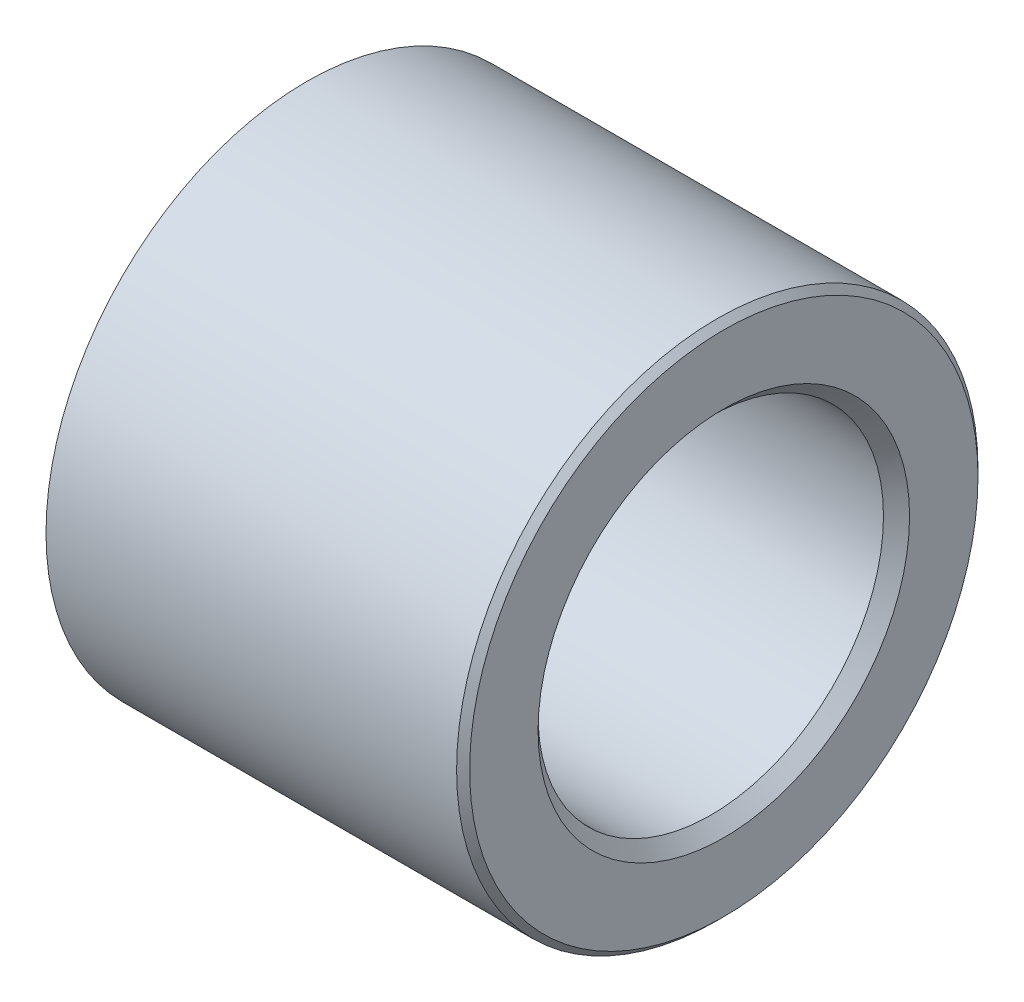
ISO-10303-21;
HEADER;
FILE_DESCRIPTION(('STEP AP214'),'2;1');
FILE_NAME('part.step','',(''),(''),'','','');
FILE_SCHEMA(('AUTOMOTIVE_DESIGN { 1 0 10303 214 1 1 1 1 }'));
ENDSEC;
DATA;
#1=APPLICATION_CONTEXT('core data for automotive mechanical design processes');
#2=APPLICATION_PROTOCOL_DEFINITION('international standard','automotive_design',2000,#1);
#3=PRODUCT_CONTEXT('',#1,'mechanical');
#4=PRODUCT('Part','Part','',(#3));
#5=PRODUCT_RELATED_PRODUCT_CATEGORY('part','',(#4));
#6=PRODUCT_DEFINITION_FORMATION('','',#4);
#7=PRODUCT_DEFINITION_CONTEXT('part definition',#1,'design');
#8=PRODUCT_DEFINITION('design','',#6,#7);
#9=PRODUCT_DEFINITION_SHAPE('','',#8);
#10=(LENGTH_UNIT() NAMED_UNIT(*) SI_UNIT(.MILLI.,.METRE.));
#11=(NAMED_UNIT(*) PLANE_ANGLE_UNIT() SI_UNIT($,.RADIAN.));
#12=(NAMED_UNIT(*) SI_UNIT($,.STERADIAN.) SOLID_ANGLE_UNIT());
#13=UNCERTAINTY_MEASURE_WITH_UNIT(LENGTH_MEASURE(1.E-05),#10,'distance_accuracy_value','');
#14=(GEOMETRIC_REPRESENTATION_CONTEXT(3) GLOBAL_UNCERTAINTY_ASSIGNED_CONTEXT((#13)) GLOBAL_UNIT_ASSIGNED_CONTEXT((#10,
#11,#12)) REPRESENTATION_CONTEXT('',''));
#15=CARTESIAN_POINT('',(0.,0.,0.));
#16=DIRECTION('',(0.,0.,1.));
#17=DIRECTION('',(1.,0.,0.));
#18=AXIS2_PLACEMENT_3D('',#15,#16,#17);
#19=CARTESIAN_POINT('',(6.4,0.,0.));
#20=DIRECTION('',(1.,0.,0.));
#21=DIRECTION('',(0.,0.,-1.));
#22=AXIS2_PLACEMENT_3D('',#19,#20,#21);
#23=PLANE('',#22);
#24=CARTESIAN_POINT('',(6.4,0.,0.));
#25=DIRECTION('',(1.,0.,0.));
#26=DIRECTION('',(0.,0.,-1.));
#27=AXIS2_PLACEMENT_3D('',#24,#25,#26);
#28=CIRCLE('',#27,2.85);
#29=CARTESIAN_POINT('',(6.4,0.,-2.85));
#30=VERTEX_POINT('',#29);
#31=EDGE_CURVE('E20',#30,#30,#28,.F.);
#32=ORIENTED_EDGE('',*,*,#31,.T.);
#33=EDGE_LOOP('',(#32));
#34=FACE_BOUND('',#33,.T.);
#35=CARTESIAN_POINT('',(6.4,0.,0.));
#36=DIRECTION('',(1.,0.,0.));
#37=DIRECTION('',(0.,0.,-1.));
#38=AXIS2_PLACEMENT_3D('',#35,#36,#37);
#39=CIRCLE('',#38,3.9);
#40=CARTESIAN_POINT('',(6.4,0.,-3.9));
#41=VERTEX_POINT('',#40);
#42=EDGE_CURVE('E36',#41,#41,#39,.T.);
#43=ORIENTED_EDGE('',*,*,#42,.T.);
#44=EDGE_LOOP('',(#43));
#45=FACE_BOUND('',#44,.T.);
#46=ADVANCED_FACE('F13',(#34,#45),#23,.T.);
#47=CARTESIAN_POINT('',(0.,0.,0.));
#48=DIRECTION('',(1.,0.,0.));
#49=DIRECTION('',(0.,0.,-1.));
#50=AXIS2_PLACEMENT_3D('',#47,#48,#49);
#51=PLANE('',#50);
#52=CARTESIAN_POINT('',(0.,0.,0.));
#53=DIRECTION('',(1.,0.,0.));
#54=DIRECTION('',(0.,0.,-1.));
#55=AXIS2_PLACEMENT_3D('',#52,#53,#54);
#56=CIRCLE('',#55,2.85);
#57=CARTESIAN_POINT('',(0.,0.,-2.85));
#58=VERTEX_POINT('',#57);
#59=EDGE_CURVE('E8',#58,#58,#56,.T.);
#60=ORIENTED_EDGE('',*,*,#59,.T.);
#61=EDGE_LOOP('',(#60));
#62=FACE_BOUND('',#61,.T.);
#63=CARTESIAN_POINT('',(0.,0.,0.));
#64=DIRECTION('',(1.,0.,0.));
#65=DIRECTION('',(0.,0.,-1.));
#66=AXIS2_PLACEMENT_3D('',#63,#64,#65);
#67=CIRCLE('',#66,4.);
#68=CARTESIAN_POINT('',(0.,0.,-4.));
#69=VERTEX_POINT('',#68);
#70=EDGE_CURVE('E39',#69,#69,#67,.T.);
#71=ORIENTED_EDGE('',*,*,#70,.F.);
#72=EDGE_LOOP('',(#71));
#73=FACE_BOUND('',#72,.T.);
#74=ADVANCED_FACE('F45',(#62,#73),#51,.F.);
#75=CARTESIAN_POINT('',(6.4,0.,0.));
#76=DIRECTION('',(-1.,0.,0.));
#77=DIRECTION('',(0.,0.,1.));
#78=AXIS2_PLACEMENT_3D('',#75,#76,#77);
#79=CYLINDRICAL_SURFACE('',#78,4.);
#80=CARTESIAN_POINT('',(6.3,0.,0.));
#81=DIRECTION('',(1.,0.,0.));
#82=DIRECTION('',(0.,0.,-1.));
#83=AXIS2_PLACEMENT_3D('',#80,#81,#82);
#84=CIRCLE('',#83,4.);
#85=CARTESIAN_POINT('',(6.3,0.,-4.));
#86=VERTEX_POINT('',#85);
#87=EDGE_CURVE('E33',#86,#86,#84,.F.);
#88=ORIENTED_EDGE('',*,*,#87,.T.);
#89=EDGE_LOOP('',(#88));
#90=FACE_BOUND('',#89,.T.);
#91=ORIENTED_EDGE('',*,*,#70,.T.);
#92=EDGE_LOOP('',(#91));
#93=FACE_BOUND('',#92,.T.);
#94=ADVANCED_FACE('F43',(#90,#93),#79,.T.);
#95=CARTESIAN_POINT('',(6.4,0.,0.));
#96=DIRECTION('',(-1.,0.,0.));
#97=DIRECTION('',(0.,0.,1.));
#98=AXIS2_PLACEMENT_3D('',#95,#96,#97);
#99=CYLINDRICAL_SURFACE('',#98,2.65);
#100=CARTESIAN_POINT('',(6.2,0.,0.));
#101=DIRECTION('',(1.,0.,0.));
#102=DIRECTION('',(0.,0.,-1.));
#103=AXIS2_PLACEMENT_3D('',#100,#101,#102);
#104=CIRCLE('',#103,2.65);
#105=CARTESIAN_POINT('',(6.2,0.,-2.65));
#106=VERTEX_POINT('',#105);
#107=EDGE_CURVE('E24',#106,#106,#104,.T.);
#108=ORIENTED_EDGE('',*,*,#107,.T.);
#109=EDGE_LOOP('',(#108));
#110=FACE_BOUND('',#109,.T.);
#111=CARTESIAN_POINT('',(0.200000000000001,0.,0.));
#112=DIRECTION('',(1.,0.,0.));
#113=DIRECTION('',(0.,0.,-1.));
#114=AXIS2_PLACEMENT_3D('',#111,#112,#113);
#115=CIRCLE('',#114,2.65);
#116=CARTESIAN_POINT('',(0.200000000000001,0.,-2.65));
#117=VERTEX_POINT('',#116);
#118=EDGE_CURVE('E28',#117,#117,#115,.F.);
#119=ORIENTED_EDGE('',*,*,#118,.T.);
#120=EDGE_LOOP('',(#119));
#121=FACE_BOUND('',#120,.T.);
#122=ADVANCED_FACE('F53',(#110,#121),#99,.F.);
#123=CARTESIAN_POINT('',(6.4,0.,0.));
#124=DIRECTION('',(-1.,0.,0.));
#125=DIRECTION('',(0.,0.,1.));
#126=AXIS2_PLACEMENT_3D('',#123,#124,#125);
#127=CONICAL_SURFACE('',#126,3.9,0.785398163397457);
#128=ORIENTED_EDGE('',*,*,#87,.F.);
#129=EDGE_LOOP('',(#128));
#130=FACE_BOUND('',#129,.T.);
#131=ORIENTED_EDGE('',*,*,#42,.F.);
#132=EDGE_LOOP('',(#131));
#133=FACE_BOUND('',#132,.T.);
#134=ADVANCED_FACE('F59',(#130,#133),#127,.T.);
#135=CARTESIAN_POINT('',(6.2,0.,0.));
#136=DIRECTION('',(1.,0.,0.));
#137=DIRECTION('',(0.,0.,-1.));
#138=AXIS2_PLACEMENT_3D('',#135,#136,#137);
#139=CONICAL_SURFACE('',#138,2.65,0.785398163397451);
#140=ORIENTED_EDGE('',*,*,#31,.F.);
#141=EDGE_LOOP('',(#140));
#142=FACE_BOUND('',#141,.T.);
#143=ORIENTED_EDGE('',*,*,#107,.F.);
#144=EDGE_LOOP('',(#143));
#145=FACE_BOUND('',#144,.T.);
#146=ADVANCED_FACE('F61',(#142,#145),#139,.F.);
#147=CARTESIAN_POINT('',(0.,0.,0.));
#148=DIRECTION('',(-1.,0.,0.));
#149=DIRECTION('',(0.,0.,1.));
#150=AXIS2_PLACEMENT_3D('',#147,#148,#149);
#151=CONICAL_SURFACE('',#150,2.85,0.785398163397445);
#152=ORIENTED_EDGE('',*,*,#118,.F.);
#153=EDGE_LOOP('',(#152));
#154=FACE_BOUND('',#153,.T.);
#155=ORIENTED_EDGE('',*,*,#59,.F.);
#156=EDGE_LOOP('',(#155));
#157=FACE_BOUND('',#156,.T.);
#158=ADVANCED_FACE('F15',(#154,#157),#151,.F.);
#159=CLOSED_SHELL('',(#46,#74,#94,#122,#134,#146,#158));
#160=MANIFOLD_SOLID_BREP('B1',#159);
#161=ADVANCED_BREP_SHAPE_REPRESENTATION('',(#18,#160),#14);
#162=SHAPE_DEFINITION_REPRESENTATION(#9,#161);
ENDSEC;
END-ISO-10303-21;
